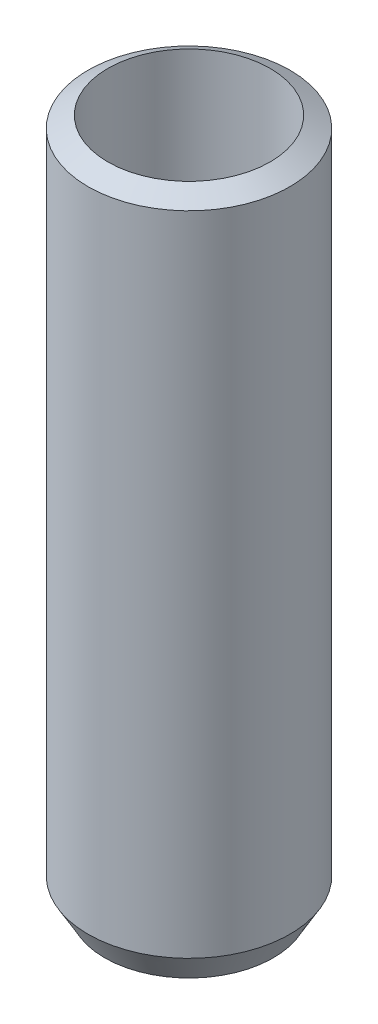
ISO-10303-21;
HEADER;
FILE_DESCRIPTION(('STEP AP214'),'2;1');
FILE_NAME('part.step','',(''),(''),'','','');
FILE_SCHEMA(('AUTOMOTIVE_DESIGN { 1 0 10303 214 1 1 1 1 }'));
ENDSEC;
DATA;
#1=APPLICATION_CONTEXT('core data for automotive mechanical design processes');
#2=APPLICATION_PROTOCOL_DEFINITION('international standard','automotive_design',2000,#1);
#3=PRODUCT_CONTEXT('',#1,'mechanical');
#4=PRODUCT('Part','Part','',(#3));
#5=PRODUCT_RELATED_PRODUCT_CATEGORY('part','',(#4));
#6=PRODUCT_DEFINITION_FORMATION('','',#4);
#7=PRODUCT_DEFINITION_CONTEXT('part definition',#1,'design');
#8=PRODUCT_DEFINITION('design','',#6,#7);
#9=PRODUCT_DEFINITION_SHAPE('','',#8);
#10=(LENGTH_UNIT() NAMED_UNIT(*) SI_UNIT(.MILLI.,.METRE.));
#11=(NAMED_UNIT(*) PLANE_ANGLE_UNIT() SI_UNIT($,.RADIAN.));
#12=(NAMED_UNIT(*) SI_UNIT($,.STERADIAN.) SOLID_ANGLE_UNIT());
#13=UNCERTAINTY_MEASURE_WITH_UNIT(LENGTH_MEASURE(1.E-05),#10,'distance_accuracy_value','');
#14=(GEOMETRIC_REPRESENTATION_CONTEXT(3) GLOBAL_UNCERTAINTY_ASSIGNED_CONTEXT((#13)) GLOBAL_UNIT_ASSIGNED_CONTEXT((#10,
#11,#12)) REPRESENTATION_CONTEXT('',''));
#15=CARTESIAN_POINT('',(0.,0.,0.));
#16=DIRECTION('',(0.,0.,1.));
#17=DIRECTION('',(1.,0.,0.));
#18=AXIS2_PLACEMENT_3D('',#15,#16,#17);
#19=CARTESIAN_POINT('',(0.,240.218122910333,0.));
#20=DIRECTION('',(0.,-1.,0.));
#21=DIRECTION('',(0.,0.,-1.));
#22=AXIS2_PLACEMENT_3D('',#19,#20,#21);
#23=CYLINDRICAL_SURFACE('',#22,35.);
#24=CARTESIAN_POINT('',(0.,234.448138467045,0.));
#25=DIRECTION('',(0.,1.,0.));
#26=DIRECTION('',(0.,0.,1.));
#27=AXIS2_PLACEMENT_3D('',#24,#25,#26);
#28=CIRCLE('',#27,35.);
#29=CARTESIAN_POINT('',(0.,234.448138467045,35.));
#30=VERTEX_POINT('',#29);
#31=EDGE_CURVE('E50',#30,#30,#28,.F.);
#32=ORIENTED_EDGE('',*,*,#31,.T.);
#33=EDGE_LOOP('',(#32));
#34=FACE_BOUND('',#33,.T.);
#35=CARTESIAN_POINT('',(0.,9.99390621465615,0.));
#36=DIRECTION('',(0.,1.,0.));
#37=DIRECTION('',(0.,0.,1.));
#38=AXIS2_PLACEMENT_3D('',#35,#36,#37);
#39=CIRCLE('',#38,35.);
#40=CARTESIAN_POINT('',(0.,9.99390621465615,35.));
#41=VERTEX_POINT('',#40);
#42=EDGE_CURVE('E51',#41,#41,#39,.T.);
#43=ORIENTED_EDGE('',*,*,#42,.T.);
#44=EDGE_LOOP('',(#43));
#45=FACE_BOUND('',#44,.T.);
#46=ADVANCED_FACE('F39',(#34,#45),#23,.T.);
#47=CARTESIAN_POINT('',(0.,0.,0.));
#48=DIRECTION('',(0.,1.,0.));
#49=DIRECTION('',(0.,0.,1.));
#50=AXIS2_PLACEMENT_3D('',#47,#48,#49);
#51=PLANE('',#50);
#52=CARTESIAN_POINT('',(0.,0.,0.));
#53=DIRECTION('',(0.,1.,0.));
#54=DIRECTION('',(0.,0.,1.));
#55=AXIS2_PLACEMENT_3D('',#52,#53,#54);
#56=CIRCLE('',#55,29.2300155567124);
#57=CARTESIAN_POINT('',(0.,0.,29.2300155567124));
#58=VERTEX_POINT('',#57);
#59=EDGE_CURVE('E10',#58,#58,#56,.F.);
#60=ORIENTED_EDGE('',*,*,#59,.T.);
#61=EDGE_LOOP('',(#60));
#62=FACE_BOUND('',#61,.T.);
#63=CARTESIAN_POINT('',(0.,0.,0.));
#64=DIRECTION('',(0.,1.,0.));
#65=DIRECTION('',(0.,0.,1.));
#66=AXIS2_PLACEMENT_3D('',#63,#64,#65);
#67=CIRCLE('',#66,28.1204855961477);
#68=CARTESIAN_POINT('',(0.,0.,28.1204855961477));
#69=VERTEX_POINT('',#68);
#70=EDGE_CURVE('E58',#69,#69,#67,.T.);
#71=ORIENTED_EDGE('',*,*,#70,.T.);
#72=EDGE_LOOP('',(#71));
#73=FACE_BOUND('',#72,.T.);
#74=ADVANCED_FACE('F62',(#62,#73),#51,.F.);
#75=CARTESIAN_POINT('',(0.,240.218122910333,0.));
#76=DIRECTION('',(0.,-1.,0.));
#77=DIRECTION('',(0.,0.,-1.));
#78=AXIS2_PLACEMENT_3D('',#75,#76,#77);
#79=CYLINDRICAL_SURFACE('',#78,28.1204855961477);
#80=CARTESIAN_POINT('',(0.,238.420027960003,0.));
#81=DIRECTION('',(0.,-1.,0.));
#82=DIRECTION('',(0.,0.,-1.));
#83=AXIS2_PLACEMENT_3D('',#80,#81,#82);
#84=CIRCLE('',#83,28.1204855961477);
#85=CARTESIAN_POINT('',(0.,238.420027960003,-28.1204855961477));
#86=VERTEX_POINT('',#85);
#87=EDGE_CURVE('E54',#86,#86,#84,.F.);
#88=ORIENTED_EDGE('',*,*,#87,.T.);
#89=EDGE_LOOP('',(#88));
#90=FACE_BOUND('',#89,.T.);
#91=ORIENTED_EDGE('',*,*,#70,.F.);
#92=EDGE_LOOP('',(#91));
#93=FACE_BOUND('',#92,.T.);
#94=ADVANCED_FACE('F68',(#90,#93),#79,.F.);
#95=CARTESIAN_POINT('',(0.,240.218122910333,0.));
#96=DIRECTION('',(0.,-1.,0.));
#97=DIRECTION('',(0.,0.,-1.));
#98=AXIS2_PLACEMENT_3D('',#95,#96,#97);
#99=CONICAL_SURFACE('',#98,25.0060937853436,1.0471975511966);
#100=ORIENTED_EDGE('',*,*,#31,.F.);
#101=EDGE_LOOP('',(#100));
#102=FACE_BOUND('',#101,.T.);
#103=ORIENTED_EDGE('',*,*,#87,.F.);
#104=EDGE_LOOP('',(#103));
#105=FACE_BOUND('',#104,.T.);
#106=ADVANCED_FACE('F66',(#102,#105),#99,.T.);
#107=CARTESIAN_POINT('',(0.,9.99390621465615,0.));
#108=DIRECTION('',(0.,1.,0.));
#109=DIRECTION('',(0.,0.,1.));
#110=AXIS2_PLACEMENT_3D('',#107,#108,#109);
#111=CONICAL_SURFACE('',#110,35.,0.523598775598303);
#112=ORIENTED_EDGE('',*,*,#59,.F.);
#113=EDGE_LOOP('',(#112));
#114=FACE_BOUND('',#113,.T.);
#115=ORIENTED_EDGE('',*,*,#42,.F.);
#116=EDGE_LOOP('',(#115));
#117=FACE_BOUND('',#116,.T.);
#118=ADVANCED_FACE('F45',(#114,#117),#111,.T.);
#119=CLOSED_SHELL('',(#46,#74,#94,#106,#118));
#120=MANIFOLD_SOLID_BREP('B2',#119);
#121=ADVANCED_BREP_SHAPE_REPRESENTATION('',(#18,#120),#14);
#122=SHAPE_DEFINITION_REPRESENTATION(#9,#121);
ENDSEC;
END-ISO-10303-21;
